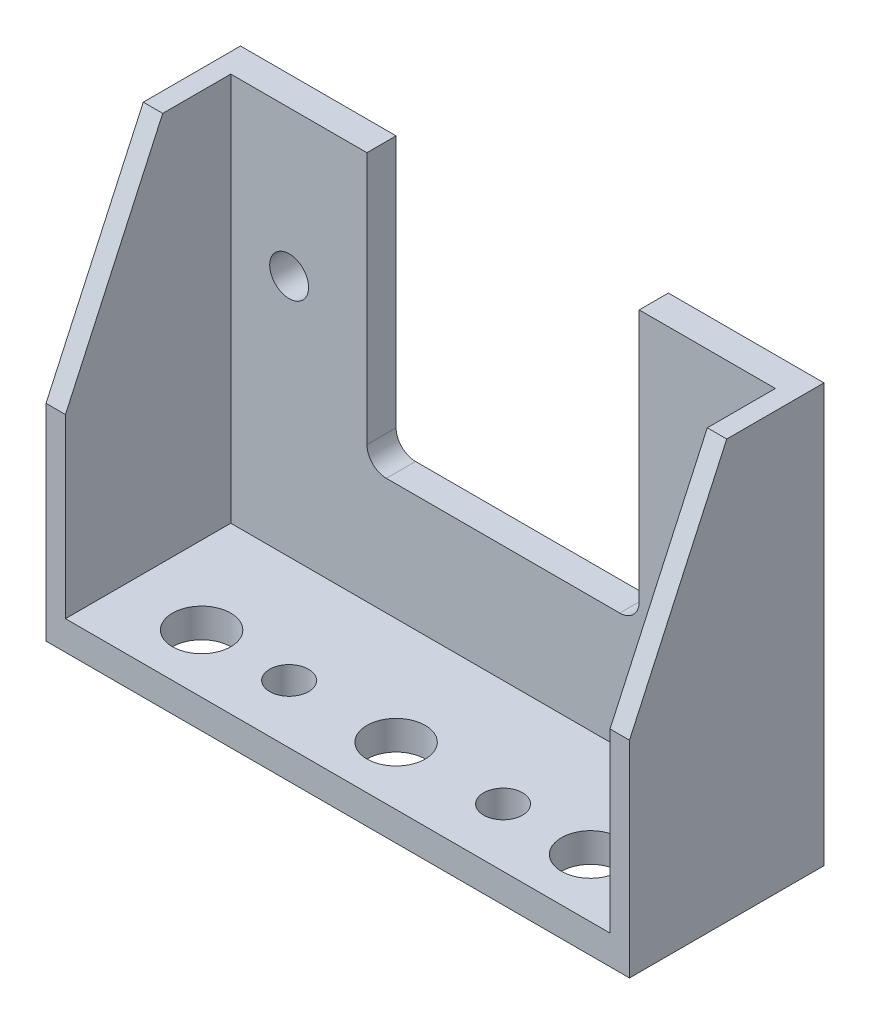
ISO-10303-21;
HEADER;
FILE_DESCRIPTION(('STEP AP214'),'2;1');
FILE_NAME('part.step','',(''),(''),'','','');
FILE_SCHEMA(('AUTOMOTIVE_DESIGN { 1 0 10303 214 1 1 1 1 }'));
ENDSEC;
DATA;
#1=APPLICATION_CONTEXT('core data for automotive mechanical design processes');
#2=APPLICATION_PROTOCOL_DEFINITION('international standard','automotive_design',2000,#1);
#3=PRODUCT_CONTEXT('',#1,'mechanical');
#4=PRODUCT('Part','Part','',(#3));
#5=PRODUCT_RELATED_PRODUCT_CATEGORY('part','',(#4));
#6=PRODUCT_DEFINITION_FORMATION('','',#4);
#7=PRODUCT_DEFINITION_CONTEXT('part definition',#1,'design');
#8=PRODUCT_DEFINITION('design','',#6,#7);
#9=PRODUCT_DEFINITION_SHAPE('','',#8);
#10=(LENGTH_UNIT() NAMED_UNIT(*) SI_UNIT(.MILLI.,.METRE.));
#11=(NAMED_UNIT(*) PLANE_ANGLE_UNIT() SI_UNIT($,.RADIAN.));
#12=(NAMED_UNIT(*) SI_UNIT($,.STERADIAN.) SOLID_ANGLE_UNIT());
#13=UNCERTAINTY_MEASURE_WITH_UNIT(LENGTH_MEASURE(1.E-05),#10,'distance_accuracy_value','');
#14=(GEOMETRIC_REPRESENTATION_CONTEXT(3) GLOBAL_UNCERTAINTY_ASSIGNED_CONTEXT((#13)) GLOBAL_UNIT_ASSIGNED_CONTEXT((#10,
#11,#12)) REPRESENTATION_CONTEXT('',''));
#15=CARTESIAN_POINT('',(0.,0.,0.));
#16=DIRECTION('',(0.,0.,1.));
#17=DIRECTION('',(1.,0.,0.));
#18=AXIS2_PLACEMENT_3D('',#15,#16,#17);
#19=CARTESIAN_POINT('',(0.,0.75,0.));
#20=DIRECTION('',(0.,1.,0.));
#21=DIRECTION('',(0.,0.,1.));
#22=AXIS2_PLACEMENT_3D('',#19,#20,#21);
#23=PLANE('',#22);
#24=CARTESIAN_POINT('',(-10.,0.75,2.));
#25=DIRECTION('',(0.,1.,0.));
#26=DIRECTION('',(0.,0.,1.));
#27=AXIS2_PLACEMENT_3D('',#24,#25,#26);
#28=CIRCLE('',#27,1.5);
#29=CARTESIAN_POINT('',(-10.,0.75,3.5));
#30=VERTEX_POINT('',#29);
#31=EDGE_CURVE('E299',#30,#30,#28,.T.);
#32=ORIENTED_EDGE('',*,*,#31,.F.);
#33=EDGE_LOOP('',(#32));
#34=FACE_BOUND('',#33,.T.);
#35=CARTESIAN_POINT('',(5.5,0.75,2.));
#36=DIRECTION('',(0.,1.,0.));
#37=DIRECTION('',(0.,0.,-1.));
#38=AXIS2_PLACEMENT_3D('',#35,#36,#37);
#39=CIRCLE('',#38,1.);
#40=CARTESIAN_POINT('',(5.5,0.75,0.999999999999999));
#41=VERTEX_POINT('',#40);
#42=EDGE_CURVE('E304',#41,#41,#39,.T.);
#43=ORIENTED_EDGE('',*,*,#42,.F.);
#44=EDGE_LOOP('',(#43));
#45=FACE_BOUND('',#44,.T.);
#46=CARTESIAN_POINT('',(-5.5,0.75,2.));
#47=DIRECTION('',(0.,1.,0.));
#48=DIRECTION('',(0.,0.,1.));
#49=AXIS2_PLACEMENT_3D('',#46,#47,#48);
#50=CIRCLE('',#49,1.);
#51=CARTESIAN_POINT('',(-5.5,0.75,3.));
#52=VERTEX_POINT('',#51);
#53=EDGE_CURVE('E319',#52,#52,#50,.T.);
#54=ORIENTED_EDGE('',*,*,#53,.F.);
#55=EDGE_LOOP('',(#54));
#56=FACE_BOUND('',#55,.T.);
#57=CARTESIAN_POINT('',(10.,0.75,2.));
#58=DIRECTION('',(0.,1.,0.));
#59=DIRECTION('',(0.,0.,-1.));
#60=AXIS2_PLACEMENT_3D('',#57,#58,#59);
#61=CIRCLE('',#60,1.5);
#62=CARTESIAN_POINT('',(10.,0.75,0.499999999999999));
#63=VERTEX_POINT('',#62);
#64=EDGE_CURVE('E303',#63,#63,#61,.T.);
#65=ORIENTED_EDGE('',*,*,#64,.F.);
#66=EDGE_LOOP('',(#65));
#67=FACE_BOUND('',#66,.T.);
#68=CARTESIAN_POINT('',(0.,0.75,2.));
#69=DIRECTION('',(0.,1.,0.));
#70=DIRECTION('',(0.,0.,1.));
#71=AXIS2_PLACEMENT_3D('',#68,#69,#70);
#72=CIRCLE('',#71,1.5);
#73=CARTESIAN_POINT('',(0.,0.75,3.5));
#74=VERTEX_POINT('',#73);
#75=EDGE_CURVE('E326',#74,#74,#72,.T.);
#76=ORIENTED_EDGE('',*,*,#75,.F.);
#77=EDGE_LOOP('',(#76));
#78=FACE_BOUND('',#77,.T.);
#79=DIRECTION('',(-1.,0.,0.));
#80=VECTOR('',#79,1.);
#81=CARTESIAN_POINT('',(0.,0.75,-3.5));
#82=LINE('',#81,#80);
#83=CARTESIAN_POINT('',(14.,0.75,-3.5));
#84=VERTEX_POINT('',#83);
#85=CARTESIAN_POINT('',(-14.,0.75,-3.5));
#86=VERTEX_POINT('',#85);
#87=EDGE_CURVE('E261',#84,#86,#82,.T.);
#88=ORIENTED_EDGE('',*,*,#87,.T.);
#89=DIRECTION('',(0.,0.,1.));
#90=VECTOR('',#89,1.);
#91=CARTESIAN_POINT('',(-14.,0.75,0.));
#92=LINE('',#91,#90);
#93=CARTESIAN_POINT('',(-14.,0.75,5.));
#94=VERTEX_POINT('',#93);
#95=EDGE_CURVE('E66',#86,#94,#92,.T.);
#96=ORIENTED_EDGE('',*,*,#95,.T.);
#97=DIRECTION('',(1.,0.,0.));
#98=VECTOR('',#97,1.);
#99=CARTESIAN_POINT('',(-15.,0.75,5.));
#100=LINE('',#99,#98);
#101=CARTESIAN_POINT('',(14.,0.75,5.));
#102=VERTEX_POINT('',#101);
#103=EDGE_CURVE('E334',#94,#102,#100,.T.);
#104=ORIENTED_EDGE('',*,*,#103,.T.);
#105=DIRECTION('',(0.,0.,1.));
#106=VECTOR('',#105,1.);
#107=CARTESIAN_POINT('',(14.,0.75,0.));
#108=LINE('',#107,#106);
#109=EDGE_CURVE('E220',#84,#102,#108,.T.);
#110=ORIENTED_EDGE('',*,*,#109,.F.);
#111=EDGE_LOOP('',(#88,#96,#104,#110));
#112=FACE_BOUND('',#111,.T.);
#113=ADVANCED_FACE('F43',(#34,#45,#56,#67,#78,#112),#23,.T.);
#114=CARTESIAN_POINT('',(0.,0.,-3.5));
#115=DIRECTION('',(0.,0.,1.));
#116=DIRECTION('',(1.,0.,0.));
#117=AXIS2_PLACEMENT_3D('',#114,#115,#116);
#118=PLANE('',#117);
#119=CARTESIAN_POINT('',(-11.,13.25,-3.5));
#120=DIRECTION('',(0.,0.,1.));
#121=DIRECTION('',(1.,0.,0.));
#122=AXIS2_PLACEMENT_3D('',#119,#120,#121);
#123=CIRCLE('',#122,1.);
#124=CARTESIAN_POINT('',(-10.,13.25,-3.5));
#125=VERTEX_POINT('',#124);
#126=EDGE_CURVE('E238',#125,#125,#123,.T.);
#127=ORIENTED_EDGE('',*,*,#126,.F.);
#128=EDGE_LOOP('',(#127));
#129=FACE_BOUND('',#128,.T.);
#130=CARTESIAN_POINT('',(11.,13.25,-3.5));
#131=DIRECTION('',(0.,0.,1.));
#132=DIRECTION('',(1.,0.,0.));
#133=AXIS2_PLACEMENT_3D('',#130,#131,#132);
#134=CIRCLE('',#133,1.);
#135=CARTESIAN_POINT('',(12.,13.25,-3.5));
#136=VERTEX_POINT('',#135);
#137=EDGE_CURVE('E233',#136,#136,#134,.T.);
#138=ORIENTED_EDGE('',*,*,#137,.F.);
#139=EDGE_LOOP('',(#138));
#140=FACE_BOUND('',#139,.T.);
#141=DIRECTION('',(-1.,0.,0.));
#142=VECTOR('',#141,1.);
#143=CARTESIAN_POINT('',(0.,20.75,-3.5));
#144=LINE('',#143,#142);
#145=CARTESIAN_POINT('',(-7.,20.75,-3.5));
#146=VERTEX_POINT('',#145);
#147=CARTESIAN_POINT('',(-14.,20.75,-3.5));
#148=VERTEX_POINT('',#147);
#149=EDGE_CURVE('E249',#146,#148,#144,.T.);
#150=ORIENTED_EDGE('',*,*,#149,.T.);
#151=DIRECTION('',(0.,-1.,0.));
#152=VECTOR('',#151,1.);
#153=CARTESIAN_POINT('',(-14.,0.,-3.5));
#154=LINE('',#153,#152);
#155=EDGE_CURVE('E59',#148,#86,#154,.T.);
#156=ORIENTED_EDGE('',*,*,#155,.T.);
#157=ORIENTED_EDGE('',*,*,#87,.F.);
#158=DIRECTION('',(0.,-1.,0.));
#159=VECTOR('',#158,1.);
#160=CARTESIAN_POINT('',(14.,0.,-3.5));
#161=LINE('',#160,#159);
#162=CARTESIAN_POINT('',(14.,20.75,-3.5));
#163=VERTEX_POINT('',#162);
#164=EDGE_CURVE('E209',#163,#84,#161,.T.);
#165=ORIENTED_EDGE('',*,*,#164,.F.);
#166=CARTESIAN_POINT('',(7.,20.75,-3.5));
#167=VERTEX_POINT('',#166);
#168=EDGE_CURVE('E244',#163,#167,#144,.T.);
#169=ORIENTED_EDGE('',*,*,#168,.T.);
#170=DIRECTION('',(0.,-1.,0.));
#171=VECTOR('',#170,1.);
#172=CARTESIAN_POINT('',(7.,0.,-3.5));
#173=LINE('',#172,#171);
#174=CARTESIAN_POINT('',(7.,7.75,-3.5));
#175=VERTEX_POINT('',#174);
#176=EDGE_CURVE('E247',#167,#175,#173,.T.);
#177=ORIENTED_EDGE('',*,*,#176,.T.);
#178=CARTESIAN_POINT('',(6.,7.75,-3.5));
#179=DIRECTION('',(0.,0.,1.));
#180=DIRECTION('',(1.,0.,0.));
#181=AXIS2_PLACEMENT_3D('',#178,#179,#180);
#182=CIRCLE('',#181,1.);
#183=CARTESIAN_POINT('',(6.,6.75,-3.5));
#184=VERTEX_POINT('',#183);
#185=EDGE_CURVE('E380',#175,#184,#182,.F.);
#186=ORIENTED_EDGE('',*,*,#185,.T.);
#187=DIRECTION('',(1.,0.,0.));
#188=VECTOR('',#187,1.);
#189=CARTESIAN_POINT('',(0.,6.75,-3.5));
#190=LINE('',#189,#188);
#191=CARTESIAN_POINT('',(-6.,6.75,-3.5));
#192=VERTEX_POINT('',#191);
#193=EDGE_CURVE('E253',#192,#184,#190,.T.);
#194=ORIENTED_EDGE('',*,*,#193,.F.);
#195=CARTESIAN_POINT('',(-6.,7.75,-3.5));
#196=DIRECTION('',(0.,0.,1.));
#197=DIRECTION('',(1.,0.,0.));
#198=AXIS2_PLACEMENT_3D('',#195,#196,#197);
#199=CIRCLE('',#198,1.);
#200=CARTESIAN_POINT('',(-7.,7.75,-3.5));
#201=VERTEX_POINT('',#200);
#202=EDGE_CURVE('E11',#192,#201,#199,.F.);
#203=ORIENTED_EDGE('',*,*,#202,.T.);
#204=DIRECTION('',(0.,-1.,0.));
#205=VECTOR('',#204,1.);
#206=CARTESIAN_POINT('',(-6.99999999999999,0.,-3.5));
#207=LINE('',#206,#205);
#208=EDGE_CURVE('E257',#146,#201,#207,.T.);
#209=ORIENTED_EDGE('',*,*,#208,.F.);
#210=EDGE_LOOP('',(#150,#156,#157,#165,#169,#177,#186,#194,#203,#209));
#211=FACE_BOUND('',#210,.T.);
#212=ADVANCED_FACE('F397',(#129,#140,#211),#118,.T.);
#213=CARTESIAN_POINT('',(0.,-0.75,0.));
#214=DIRECTION('',(0.,1.,0.));
#215=DIRECTION('',(0.,0.,1.));
#216=AXIS2_PLACEMENT_3D('',#213,#214,#215);
#217=PLANE('',#216);
#218=CARTESIAN_POINT('',(-10.,-0.75,2.));
#219=DIRECTION('',(0.,1.,0.));
#220=DIRECTION('',(0.,0.,1.));
#221=AXIS2_PLACEMENT_3D('',#218,#219,#220);
#222=CIRCLE('',#221,1.5);
#223=CARTESIAN_POINT('',(-10.,-0.75,3.5));
#224=VERTEX_POINT('',#223);
#225=EDGE_CURVE('E294',#224,#224,#222,.T.);
#226=ORIENTED_EDGE('',*,*,#225,.T.);
#227=EDGE_LOOP('',(#226));
#228=FACE_BOUND('',#227,.T.);
#229=CARTESIAN_POINT('',(5.5,-0.75,2.));
#230=DIRECTION('',(0.,1.,0.));
#231=DIRECTION('',(0.,0.,-1.));
#232=AXIS2_PLACEMENT_3D('',#229,#230,#231);
#233=CIRCLE('',#232,1.);
#234=CARTESIAN_POINT('',(5.5,-0.75,0.999999999999999));
#235=VERTEX_POINT('',#234);
#236=EDGE_CURVE('E293',#235,#235,#233,.T.);
#237=ORIENTED_EDGE('',*,*,#236,.T.);
#238=EDGE_LOOP('',(#237));
#239=FACE_BOUND('',#238,.T.);
#240=CARTESIAN_POINT('',(-5.5,-0.75,2.));
#241=DIRECTION('',(0.,1.,0.));
#242=DIRECTION('',(0.,0.,1.));
#243=AXIS2_PLACEMENT_3D('',#240,#241,#242);
#244=CIRCLE('',#243,1.);
#245=CARTESIAN_POINT('',(-5.5,-0.75,3.));
#246=VERTEX_POINT('',#245);
#247=EDGE_CURVE('E308',#246,#246,#244,.T.);
#248=ORIENTED_EDGE('',*,*,#247,.T.);
#249=EDGE_LOOP('',(#248));
#250=FACE_BOUND('',#249,.T.);
#251=CARTESIAN_POINT('',(10.,-0.75,2.));
#252=DIRECTION('',(0.,1.,0.));
#253=DIRECTION('',(0.,0.,-1.));
#254=AXIS2_PLACEMENT_3D('',#251,#252,#253);
#255=CIRCLE('',#254,1.5);
#256=CARTESIAN_POINT('',(10.,-0.75,0.499999999999999));
#257=VERTEX_POINT('',#256);
#258=EDGE_CURVE('E315',#257,#257,#255,.T.);
#259=ORIENTED_EDGE('',*,*,#258,.T.);
#260=EDGE_LOOP('',(#259));
#261=FACE_BOUND('',#260,.T.);
#262=DIRECTION('',(0.,0.,-1.));
#263=VECTOR('',#262,1.);
#264=CARTESIAN_POINT('',(15.,-0.75,-5.));
#265=LINE('',#264,#263);
#266=CARTESIAN_POINT('',(15.,-0.75,5.));
#267=VERTEX_POINT('',#266);
#268=CARTESIAN_POINT('',(15.,-0.75,-5.));
#269=VERTEX_POINT('',#268);
#270=EDGE_CURVE('E330',#267,#269,#265,.T.);
#271=ORIENTED_EDGE('',*,*,#270,.F.);
#272=DIRECTION('',(1.,0.,0.));
#273=VECTOR('',#272,1.);
#274=CARTESIAN_POINT('',(-15.,-0.75,5.));
#275=LINE('',#274,#273);
#276=CARTESIAN_POINT('',(-15.,-0.75,5.));
#277=VERTEX_POINT('',#276);
#278=EDGE_CURVE('E337',#277,#267,#275,.T.);
#279=ORIENTED_EDGE('',*,*,#278,.F.);
#280=DIRECTION('',(0.,0.,1.));
#281=VECTOR('',#280,1.);
#282=CARTESIAN_POINT('',(-15.,-0.75,-5.));
#283=LINE('',#282,#281);
#284=CARTESIAN_POINT('',(-15.,-0.75,-5.));
#285=VERTEX_POINT('',#284);
#286=EDGE_CURVE('E165',#285,#277,#283,.T.);
#287=ORIENTED_EDGE('',*,*,#286,.F.);
#288=DIRECTION('',(-1.,0.,0.));
#289=VECTOR('',#288,1.);
#290=CARTESIAN_POINT('',(-15.,-0.75,-5.));
#291=LINE('',#290,#289);
#292=EDGE_CURVE('E341',#269,#285,#291,.T.);
#293=ORIENTED_EDGE('',*,*,#292,.F.);
#294=EDGE_LOOP('',(#271,#279,#287,#293));
#295=FACE_BOUND('',#294,.T.);
#296=CARTESIAN_POINT('',(0.,-0.75,2.));
#297=DIRECTION('',(0.,1.,0.));
#298=DIRECTION('',(0.,0.,1.));
#299=AXIS2_PLACEMENT_3D('',#296,#297,#298);
#300=CIRCLE('',#299,1.5);
#301=CARTESIAN_POINT('',(0.,-0.75,3.5));
#302=VERTEX_POINT('',#301);
#303=EDGE_CURVE('E298',#302,#302,#300,.T.);
#304=ORIENTED_EDGE('',*,*,#303,.T.);
#305=EDGE_LOOP('',(#304));
#306=FACE_BOUND('',#305,.T.);
#307=ADVANCED_FACE('F409',(#228,#239,#250,#261,#295,#306),#217,.F.);
#308=CARTESIAN_POINT('',(15.,0.75,-5.));
#309=DIRECTION('',(-1.,0.,0.));
#310=DIRECTION('',(0.,0.,1.));
#311=AXIS2_PLACEMENT_3D('',#308,#309,#310);
#312=PLANE('',#311);
#313=ORIENTED_EDGE('',*,*,#270,.T.);
#314=DIRECTION('',(0.,-1.,0.));
#315=VECTOR('',#314,1.);
#316=CARTESIAN_POINT('',(15.,0.75,-5.));
#317=LINE('',#316,#315);
#318=CARTESIAN_POINT('',(15.,20.75,-5.));
#319=VERTEX_POINT('',#318);
#320=EDGE_CURVE('E353',#319,#269,#317,.T.);
#321=ORIENTED_EDGE('',*,*,#320,.F.);
#322=DIRECTION('',(0.,0.,-1.));
#323=VECTOR('',#322,1.);
#324=CARTESIAN_POINT('',(15.,20.75,-3.5));
#325=LINE('',#324,#323);
#326=CARTESIAN_POINT('',(15.,20.75,0.));
#327=VERTEX_POINT('',#326);
#328=EDGE_CURVE('E264',#327,#319,#325,.T.);
#329=ORIENTED_EDGE('',*,*,#328,.F.);
#330=DIRECTION('',(0.,-0.909077237208885,0.416627623650497));
#331=VECTOR('',#330,1.);
#332=CARTESIAN_POINT('',(15.,3.60175546836469,7.85899379785176));
#333=LINE('',#332,#331);
#334=CARTESIAN_POINT('',(15.,9.84005085592335,5.));
#335=VERTEX_POINT('',#334);
#336=EDGE_CURVE('E204',#327,#335,#333,.T.);
#337=ORIENTED_EDGE('',*,*,#336,.T.);
#338=DIRECTION('',(0.,-1.,0.));
#339=VECTOR('',#338,1.);
#340=CARTESIAN_POINT('',(15.,0.75,5.));
#341=LINE('',#340,#339);
#342=EDGE_CURVE('E170',#335,#267,#341,.T.);
#343=ORIENTED_EDGE('',*,*,#342,.T.);
#344=EDGE_LOOP('',(#313,#321,#329,#337,#343));
#345=FACE_BOUND('',#344,.T.);
#346=ADVANCED_FACE('F412',(#345),#312,.F.);
#347=CARTESIAN_POINT('',(-15.,0.75,-5.));
#348=DIRECTION('',(0.,0.,1.));
#349=DIRECTION('',(1.,0.,0.));
#350=AXIS2_PLACEMENT_3D('',#347,#348,#349);
#351=PLANE('',#350);
#352=CARTESIAN_POINT('',(-11.,13.25,-5.));
#353=DIRECTION('',(0.,0.,1.));
#354=DIRECTION('',(1.,0.,0.));
#355=AXIS2_PLACEMENT_3D('',#352,#353,#354);
#356=CIRCLE('',#355,1.);
#357=CARTESIAN_POINT('',(-10.,13.25,-5.));
#358=VERTEX_POINT('',#357);
#359=EDGE_CURVE('E239',#358,#358,#356,.T.);
#360=ORIENTED_EDGE('',*,*,#359,.T.);
#361=EDGE_LOOP('',(#360));
#362=FACE_BOUND('',#361,.T.);
#363=CARTESIAN_POINT('',(11.,13.25,-5.));
#364=DIRECTION('',(0.,0.,1.));
#365=DIRECTION('',(1.,0.,0.));
#366=AXIS2_PLACEMENT_3D('',#363,#364,#365);
#367=CIRCLE('',#366,1.);
#368=CARTESIAN_POINT('',(12.,13.25,-5.));
#369=VERTEX_POINT('',#368);
#370=EDGE_CURVE('E234',#369,#369,#367,.T.);
#371=ORIENTED_EDGE('',*,*,#370,.T.);
#372=EDGE_LOOP('',(#371));
#373=FACE_BOUND('',#372,.T.);
#374=ORIENTED_EDGE('',*,*,#292,.T.);
#375=DIRECTION('',(0.,-1.,0.));
#376=VECTOR('',#375,1.);
#377=CARTESIAN_POINT('',(-15.,0.75,-5.));
#378=LINE('',#377,#376);
#379=CARTESIAN_POINT('',(-15.,20.75,-5.));
#380=VERTEX_POINT('',#379);
#381=EDGE_CURVE('E169',#380,#285,#378,.T.);
#382=ORIENTED_EDGE('',*,*,#381,.F.);
#383=DIRECTION('',(-1.,0.,0.));
#384=VECTOR('',#383,1.);
#385=CARTESIAN_POINT('',(0.,20.75,-5.));
#386=LINE('',#385,#384);
#387=CARTESIAN_POINT('',(-7.,20.75,-5.));
#388=VERTEX_POINT('',#387);
#389=EDGE_CURVE('E248',#388,#380,#386,.T.);
#390=ORIENTED_EDGE('',*,*,#389,.F.);
#391=DIRECTION('',(0.,-1.,0.));
#392=VECTOR('',#391,1.);
#393=CARTESIAN_POINT('',(-6.99999999999999,0.,-5.));
#394=LINE('',#393,#392);
#395=CARTESIAN_POINT('',(-7.,7.75,-5.));
#396=VERTEX_POINT('',#395);
#397=EDGE_CURVE('E276',#388,#396,#394,.T.);
#398=ORIENTED_EDGE('',*,*,#397,.T.);
#399=CARTESIAN_POINT('',(-6.,7.75,-5.));
#400=DIRECTION('',(0.,0.,1.));
#401=DIRECTION('',(1.,0.,0.));
#402=AXIS2_PLACEMENT_3D('',#399,#400,#401);
#403=CIRCLE('',#402,1.);
#404=CARTESIAN_POINT('',(-6.,6.75,-5.));
#405=VERTEX_POINT('',#404);
#406=EDGE_CURVE('E52',#396,#405,#403,.T.);
#407=ORIENTED_EDGE('',*,*,#406,.T.);
#408=DIRECTION('',(1.,0.,0.));
#409=VECTOR('',#408,1.);
#410=CARTESIAN_POINT('',(0.,6.75,-5.));
#411=LINE('',#410,#409);
#412=CARTESIAN_POINT('',(6.,6.75,-5.));
#413=VERTEX_POINT('',#412);
#414=EDGE_CURVE('E272',#405,#413,#411,.T.);
#415=ORIENTED_EDGE('',*,*,#414,.T.);
#416=CARTESIAN_POINT('',(6.,7.75,-5.));
#417=DIRECTION('',(0.,0.,1.));
#418=DIRECTION('',(1.,0.,0.));
#419=AXIS2_PLACEMENT_3D('',#416,#417,#418);
#420=CIRCLE('',#419,1.);
#421=CARTESIAN_POINT('',(7.,7.75,-5.));
#422=VERTEX_POINT('',#421);
#423=EDGE_CURVE('E377',#413,#422,#420,.T.);
#424=ORIENTED_EDGE('',*,*,#423,.T.);
#425=DIRECTION('',(0.,-1.,0.));
#426=VECTOR('',#425,1.);
#427=CARTESIAN_POINT('',(7.,0.,-5.));
#428=LINE('',#427,#426);
#429=CARTESIAN_POINT('',(7.,20.75,-5.));
#430=VERTEX_POINT('',#429);
#431=EDGE_CURVE('E268',#430,#422,#428,.T.);
#432=ORIENTED_EDGE('',*,*,#431,.F.);
#433=EDGE_CURVE('E243',#319,#430,#386,.T.);
#434=ORIENTED_EDGE('',*,*,#433,.F.);
#435=ORIENTED_EDGE('',*,*,#320,.T.);
#436=EDGE_LOOP('',(#374,#382,#390,#398,#407,#415,#424,#432,#434,#435));
#437=FACE_BOUND('',#436,.T.);
#438=ADVANCED_FACE('F385',(#362,#373,#437),#351,.F.);
#439=CARTESIAN_POINT('',(-15.,0.75,-5.));
#440=DIRECTION('',(1.,0.,0.));
#441=DIRECTION('',(0.,0.,-1.));
#442=AXIS2_PLACEMENT_3D('',#439,#440,#441);
#443=PLANE('',#442);
#444=ORIENTED_EDGE('',*,*,#286,.T.);
#445=DIRECTION('',(0.,-1.,0.));
#446=VECTOR('',#445,1.);
#447=CARTESIAN_POINT('',(-15.,0.75,5.));
#448=LINE('',#447,#446);
#449=CARTESIAN_POINT('',(-15.,9.84005085592335,5.));
#450=VERTEX_POINT('',#449);
#451=EDGE_CURVE('E157',#450,#277,#448,.T.);
#452=ORIENTED_EDGE('',*,*,#451,.F.);
#453=DIRECTION('',(0.,-0.909077237208885,0.416627623650497));
#454=VECTOR('',#453,1.);
#455=CARTESIAN_POINT('',(-15.,3.60175546836469,7.85899379785176));
#456=LINE('',#455,#454);
#457=CARTESIAN_POINT('',(-15.,20.75,0.));
#458=VERTEX_POINT('',#457);
#459=EDGE_CURVE('E162',#458,#450,#456,.T.);
#460=ORIENTED_EDGE('',*,*,#459,.F.);
#461=DIRECTION('',(0.,0.,-1.));
#462=VECTOR('',#461,1.);
#463=CARTESIAN_POINT('',(-15.,20.75,-3.5));
#464=LINE('',#463,#462);
#465=EDGE_CURVE('E283',#458,#380,#464,.T.);
#466=ORIENTED_EDGE('',*,*,#465,.T.);
#467=ORIENTED_EDGE('',*,*,#381,.T.);
#468=EDGE_LOOP('',(#444,#452,#460,#466,#467));
#469=FACE_BOUND('',#468,.T.);
#470=ADVANCED_FACE('F159',(#469),#443,.F.);
#471=CARTESIAN_POINT('',(-15.,0.75,5.));
#472=DIRECTION('',(0.,0.,-1.));
#473=DIRECTION('',(-1.,0.,0.));
#474=AXIS2_PLACEMENT_3D('',#471,#472,#473);
#475=PLANE('',#474);
#476=ORIENTED_EDGE('',*,*,#278,.T.);
#477=ORIENTED_EDGE('',*,*,#342,.F.);
#478=DIRECTION('',(-1.,0.,0.));
#479=VECTOR('',#478,1.);
#480=CARTESIAN_POINT('',(15.,9.84005085592335,5.));
#481=LINE('',#480,#479);
#482=CARTESIAN_POINT('',(14.,9.84005085592335,5.));
#483=VERTEX_POINT('',#482);
#484=EDGE_CURVE('E208',#335,#483,#481,.T.);
#485=ORIENTED_EDGE('',*,*,#484,.T.);
#486=DIRECTION('',(0.,-1.,0.));
#487=VECTOR('',#486,1.);
#488=CARTESIAN_POINT('',(14.,0.,5.));
#489=LINE('',#488,#487);
#490=EDGE_CURVE('E216',#483,#102,#489,.T.);
#491=ORIENTED_EDGE('',*,*,#490,.T.);
#492=ORIENTED_EDGE('',*,*,#103,.F.);
#493=DIRECTION('',(0.,-1.,0.));
#494=VECTOR('',#493,1.);
#495=CARTESIAN_POINT('',(-14.,0.,5.));
#496=LINE('',#495,#494);
#497=CARTESIAN_POINT('',(-14.,9.84005085592335,5.));
#498=VERTEX_POINT('',#497);
#499=EDGE_CURVE('E176',#498,#94,#496,.T.);
#500=ORIENTED_EDGE('',*,*,#499,.F.);
#501=DIRECTION('',(1.,0.,0.));
#502=VECTOR('',#501,1.);
#503=CARTESIAN_POINT('',(-15.,9.84005085592335,5.));
#504=LINE('',#503,#502);
#505=EDGE_CURVE('E173',#450,#498,#504,.T.);
#506=ORIENTED_EDGE('',*,*,#505,.F.);
#507=ORIENTED_EDGE('',*,*,#451,.T.);
#508=EDGE_LOOP('',(#476,#477,#485,#491,#492,#500,#506,#507));
#509=FACE_BOUND('',#508,.T.);
#510=ADVANCED_FACE('F174',(#509),#475,.F.);
#511=CARTESIAN_POINT('',(0.,0.75,2.));
#512=DIRECTION('',(0.,-1.,0.));
#513=DIRECTION('',(0.,0.,-1.));
#514=AXIS2_PLACEMENT_3D('',#511,#512,#513);
#515=CYLINDRICAL_SURFACE('',#514,1.5);
#516=ORIENTED_EDGE('',*,*,#75,.T.);
#517=EDGE_LOOP('',(#516));
#518=FACE_BOUND('',#517,.T.);
#519=ORIENTED_EDGE('',*,*,#303,.F.);
#520=EDGE_LOOP('',(#519));
#521=FACE_BOUND('',#520,.T.);
#522=ADVANCED_FACE('F457',(#518,#521),#515,.F.);
#523=CARTESIAN_POINT('',(10.,-0.75,2.));
#524=DIRECTION('',(0.,1.,0.));
#525=DIRECTION('',(0.,0.,1.));
#526=AXIS2_PLACEMENT_3D('',#523,#524,#525);
#527=CYLINDRICAL_SURFACE('',#526,1.5);
#528=ORIENTED_EDGE('',*,*,#258,.F.);
#529=EDGE_LOOP('',(#528));
#530=FACE_BOUND('',#529,.T.);
#531=ORIENTED_EDGE('',*,*,#64,.T.);
#532=EDGE_LOOP('',(#531));
#533=FACE_BOUND('',#532,.T.);
#534=ADVANCED_FACE('F497',(#530,#533),#527,.F.);
#535=CARTESIAN_POINT('',(-5.5,-0.75,2.));
#536=DIRECTION('',(0.,1.,0.));
#537=DIRECTION('',(0.,0.,1.));
#538=AXIS2_PLACEMENT_3D('',#535,#536,#537);
#539=CYLINDRICAL_SURFACE('',#538,1.);
#540=ORIENTED_EDGE('',*,*,#247,.F.);
#541=EDGE_LOOP('',(#540));
#542=FACE_BOUND('',#541,.T.);
#543=ORIENTED_EDGE('',*,*,#53,.T.);
#544=EDGE_LOOP('',(#543));
#545=FACE_BOUND('',#544,.T.);
#546=ADVANCED_FACE('F504',(#542,#545),#539,.F.);
#547=CARTESIAN_POINT('',(5.5,-0.75,2.));
#548=DIRECTION('',(0.,1.,0.));
#549=DIRECTION('',(0.,0.,1.));
#550=AXIS2_PLACEMENT_3D('',#547,#548,#549);
#551=CYLINDRICAL_SURFACE('',#550,1.);
#552=ORIENTED_EDGE('',*,*,#236,.F.);
#553=EDGE_LOOP('',(#552));
#554=FACE_BOUND('',#553,.T.);
#555=ORIENTED_EDGE('',*,*,#42,.T.);
#556=EDGE_LOOP('',(#555));
#557=FACE_BOUND('',#556,.T.);
#558=ADVANCED_FACE('F512',(#554,#557),#551,.F.);
#559=CARTESIAN_POINT('',(-10.,-0.75,2.));
#560=DIRECTION('',(0.,1.,0.));
#561=DIRECTION('',(0.,0.,1.));
#562=AXIS2_PLACEMENT_3D('',#559,#560,#561);
#563=CYLINDRICAL_SURFACE('',#562,1.5);
#564=ORIENTED_EDGE('',*,*,#225,.F.);
#565=EDGE_LOOP('',(#564));
#566=FACE_BOUND('',#565,.T.);
#567=ORIENTED_EDGE('',*,*,#31,.T.);
#568=EDGE_LOOP('',(#567));
#569=FACE_BOUND('',#568,.T.);
#570=ADVANCED_FACE('F519',(#566,#569),#563,.F.);
#571=CARTESIAN_POINT('',(0.,20.75,-3.5));
#572=DIRECTION('',(0.,-1.,0.));
#573=DIRECTION('',(1.,0.,0.));
#574=AXIS2_PLACEMENT_3D('',#571,#572,#573);
#575=PLANE('',#574);
#576=ORIENTED_EDGE('',*,*,#433,.T.);
#577=DIRECTION('',(0.,0.,-1.));
#578=VECTOR('',#577,1.);
#579=CARTESIAN_POINT('',(7.,20.75,-3.5));
#580=LINE('',#579,#578);
#581=EDGE_CURVE('E289',#167,#430,#580,.T.);
#582=ORIENTED_EDGE('',*,*,#581,.F.);
#583=ORIENTED_EDGE('',*,*,#168,.F.);
#584=DIRECTION('',(0.,0.,1.));
#585=VECTOR('',#584,1.);
#586=CARTESIAN_POINT('',(14.,20.75,0.));
#587=LINE('',#586,#585);
#588=CARTESIAN_POINT('',(14.,20.75,0.));
#589=VERTEX_POINT('',#588);
#590=EDGE_CURVE('E181',#163,#589,#587,.T.);
#591=ORIENTED_EDGE('',*,*,#590,.T.);
#592=DIRECTION('',(-1.,0.,0.));
#593=VECTOR('',#592,1.);
#594=CARTESIAN_POINT('',(15.,20.75,0.));
#595=LINE('',#594,#593);
#596=EDGE_CURVE('E229',#327,#589,#595,.T.);
#597=ORIENTED_EDGE('',*,*,#596,.F.);
#598=ORIENTED_EDGE('',*,*,#328,.T.);
#599=EDGE_LOOP('',(#576,#582,#583,#591,#597,#598));
#600=FACE_BOUND('',#599,.T.);
#601=ADVANCED_FACE('F427',(#600),#575,.F.);
#602=CARTESIAN_POINT('',(7.,0.,-3.5));
#603=DIRECTION('',(1.,0.,0.));
#604=DIRECTION('',(0.,1.,0.));
#605=AXIS2_PLACEMENT_3D('',#602,#603,#604);
#606=PLANE('',#605);
#607=ORIENTED_EDGE('',*,*,#431,.T.);
#608=DIRECTION('',(0.,0.,-1.));
#609=VECTOR('',#608,1.);
#610=CARTESIAN_POINT('',(7.,7.75,-3.5));
#611=LINE('',#610,#609);
#612=EDGE_CURVE('E370',#422,#175,#611,.F.);
#613=ORIENTED_EDGE('',*,*,#612,.T.);
#614=ORIENTED_EDGE('',*,*,#176,.F.);
#615=ORIENTED_EDGE('',*,*,#581,.T.);
#616=EDGE_LOOP('',(#607,#613,#614,#615));
#617=FACE_BOUND('',#616,.T.);
#618=ADVANCED_FACE('F430',(#617),#606,.F.);
#619=CARTESIAN_POINT('',(0.,6.75,-3.5));
#620=DIRECTION('',(0.,1.,0.));
#621=DIRECTION('',(0.,0.,1.));
#622=AXIS2_PLACEMENT_3D('',#619,#620,#621);
#623=PLANE('',#622);
#624=ORIENTED_EDGE('',*,*,#193,.T.);
#625=DIRECTION('',(0.,0.,-1.));
#626=VECTOR('',#625,1.);
#627=CARTESIAN_POINT('',(6.,6.75,-3.5));
#628=LINE('',#627,#626);
#629=EDGE_CURVE('E366',#184,#413,#628,.T.);
#630=ORIENTED_EDGE('',*,*,#629,.T.);
#631=ORIENTED_EDGE('',*,*,#414,.F.);
#632=DIRECTION('',(0.,0.,-1.));
#633=VECTOR('',#632,1.);
#634=CARTESIAN_POINT('',(-6.,6.75,-3.5));
#635=LINE('',#634,#633);
#636=EDGE_CURVE('E357',#405,#192,#635,.F.);
#637=ORIENTED_EDGE('',*,*,#636,.T.);
#638=EDGE_LOOP('',(#624,#630,#631,#637));
#639=FACE_BOUND('',#638,.T.);
#640=ADVANCED_FACE('F392',(#639),#623,.T.);
#641=CARTESIAN_POINT('',(-6.99999999999999,0.,-3.5));
#642=DIRECTION('',(1.,0.,0.));
#643=DIRECTION('',(0.,1.,0.));
#644=AXIS2_PLACEMENT_3D('',#641,#642,#643);
#645=PLANE('',#644);
#646=ORIENTED_EDGE('',*,*,#208,.T.);
#647=DIRECTION('',(0.,0.,-1.));
#648=VECTOR('',#647,1.);
#649=CARTESIAN_POINT('',(-7.,7.75,-5.));
#650=LINE('',#649,#648);
#651=EDGE_CURVE('E373',#201,#396,#650,.T.);
#652=ORIENTED_EDGE('',*,*,#651,.T.);
#653=ORIENTED_EDGE('',*,*,#397,.F.);
#654=DIRECTION('',(0.,0.,-1.));
#655=VECTOR('',#654,1.);
#656=CARTESIAN_POINT('',(-7.,20.75,-3.5));
#657=LINE('',#656,#655);
#658=EDGE_CURVE('E286',#146,#388,#657,.T.);
#659=ORIENTED_EDGE('',*,*,#658,.F.);
#660=EDGE_LOOP('',(#646,#652,#653,#659));
#661=FACE_BOUND('',#660,.T.);
#662=ADVANCED_FACE('F399',(#661),#645,.T.);
#663=ORIENTED_EDGE('',*,*,#389,.T.);
#664=ORIENTED_EDGE('',*,*,#465,.F.);
#665=DIRECTION('',(1.,0.,0.));
#666=VECTOR('',#665,1.);
#667=CARTESIAN_POINT('',(-15.,20.75,0.));
#668=LINE('',#667,#666);
#669=CARTESIAN_POINT('',(-14.,20.75,0.));
#670=VERTEX_POINT('',#669);
#671=EDGE_CURVE('E182',#458,#670,#668,.T.);
#672=ORIENTED_EDGE('',*,*,#671,.T.);
#673=DIRECTION('',(0.,0.,1.));
#674=VECTOR('',#673,1.);
#675=CARTESIAN_POINT('',(-14.,20.75,0.));
#676=LINE('',#675,#674);
#677=EDGE_CURVE('E194',#148,#670,#676,.T.);
#678=ORIENTED_EDGE('',*,*,#677,.F.);
#679=ORIENTED_EDGE('',*,*,#149,.F.);
#680=ORIENTED_EDGE('',*,*,#658,.T.);
#681=EDGE_LOOP('',(#663,#664,#672,#678,#679,#680));
#682=FACE_BOUND('',#681,.T.);
#683=ADVANCED_FACE('F404',(#682),#575,.F.);
#684=CARTESIAN_POINT('',(11.,13.25,-10.));
#685=DIRECTION('',(0.,0.,1.));
#686=DIRECTION('',(1.,0.,0.));
#687=AXIS2_PLACEMENT_3D('',#684,#685,#686);
#688=CYLINDRICAL_SURFACE('',#687,1.);
#689=ORIENTED_EDGE('',*,*,#137,.T.);
#690=EDGE_LOOP('',(#689));
#691=FACE_BOUND('',#690,.T.);
#692=ORIENTED_EDGE('',*,*,#370,.F.);
#693=EDGE_LOOP('',(#692));
#694=FACE_BOUND('',#693,.T.);
#695=ADVANCED_FACE('F441',(#691,#694),#688,.F.);
#696=CARTESIAN_POINT('',(-11.,13.25,-10.));
#697=DIRECTION('',(0.,0.,1.));
#698=DIRECTION('',(1.,0.,0.));
#699=AXIS2_PLACEMENT_3D('',#696,#697,#698);
#700=CYLINDRICAL_SURFACE('',#699,1.);
#701=ORIENTED_EDGE('',*,*,#126,.T.);
#702=EDGE_LOOP('',(#701));
#703=FACE_BOUND('',#702,.T.);
#704=ORIENTED_EDGE('',*,*,#359,.F.);
#705=EDGE_LOOP('',(#704));
#706=FACE_BOUND('',#705,.T.);
#707=ADVANCED_FACE('F436',(#703,#706),#700,.F.);
#708=CARTESIAN_POINT('',(6.,7.75,-3.5));
#709=DIRECTION('',(0.,0.,-1.));
#710=DIRECTION('',(-1.,0.,0.));
#711=AXIS2_PLACEMENT_3D('',#708,#709,#710);
#712=CYLINDRICAL_SURFACE('',#711,1.);
#713=ORIENTED_EDGE('',*,*,#185,.F.);
#714=ORIENTED_EDGE('',*,*,#612,.F.);
#715=ORIENTED_EDGE('',*,*,#423,.F.);
#716=ORIENTED_EDGE('',*,*,#629,.F.);
#717=EDGE_LOOP('',(#713,#714,#715,#716));
#718=FACE_BOUND('',#717,.T.);
#719=ADVANCED_FACE('F434',(#718),#712,.F.);
#720=CARTESIAN_POINT('',(-6.,7.75,-3.5));
#721=DIRECTION('',(0.,0.,1.));
#722=DIRECTION('',(1.,0.,0.));
#723=AXIS2_PLACEMENT_3D('',#720,#721,#722);
#724=CYLINDRICAL_SURFACE('',#723,1.);
#725=ORIENTED_EDGE('',*,*,#202,.F.);
#726=ORIENTED_EDGE('',*,*,#636,.F.);
#727=ORIENTED_EDGE('',*,*,#406,.F.);
#728=ORIENTED_EDGE('',*,*,#651,.F.);
#729=EDGE_LOOP('',(#725,#726,#727,#728));
#730=FACE_BOUND('',#729,.T.);
#731=ADVANCED_FACE('F45',(#730),#724,.F.);
#732=CARTESIAN_POINT('',(15.,3.60175546836469,7.85899379785176));
#733=DIRECTION('',(0.,-0.416627623650497,-0.909077237208885));
#734=DIRECTION('',(0.,0.909077237208885,-0.416627623650497));
#735=AXIS2_PLACEMENT_3D('',#732,#733,#734);
#736=PLANE('',#735);
#737=DIRECTION('',(0.,-0.909077237208885,0.416627623650497));
#738=VECTOR('',#737,1.);
#739=CARTESIAN_POINT('',(14.,3.60175546836469,7.85899379785176));
#740=LINE('',#739,#738);
#741=EDGE_CURVE('E213',#589,#483,#740,.T.);
#742=ORIENTED_EDGE('',*,*,#741,.T.);
#743=ORIENTED_EDGE('',*,*,#484,.F.);
#744=ORIENTED_EDGE('',*,*,#336,.F.);
#745=ORIENTED_EDGE('',*,*,#596,.T.);
#746=EDGE_LOOP('',(#742,#743,#744,#745));
#747=FACE_BOUND('',#746,.T.);
#748=ADVANCED_FACE('F417',(#747),#736,.F.);
#749=CARTESIAN_POINT('',(14.,0.,0.));
#750=DIRECTION('',(1.,0.,0.));
#751=DIRECTION('',(0.,0.,-1.));
#752=AXIS2_PLACEMENT_3D('',#749,#750,#751);
#753=PLANE('',#752);
#754=ORIENTED_EDGE('',*,*,#590,.F.);
#755=ORIENTED_EDGE('',*,*,#164,.T.);
#756=ORIENTED_EDGE('',*,*,#109,.T.);
#757=ORIENTED_EDGE('',*,*,#490,.F.);
#758=ORIENTED_EDGE('',*,*,#741,.F.);
#759=EDGE_LOOP('',(#754,#755,#756,#757,#758));
#760=FACE_BOUND('',#759,.T.);
#761=ADVANCED_FACE('F420',(#760),#753,.F.);
#762=CARTESIAN_POINT('',(-15.,3.60175546836469,7.85899379785176));
#763=DIRECTION('',(0.,0.416627623650497,0.909077237208885));
#764=DIRECTION('',(0.,-0.909077237208885,0.416627623650497));
#765=AXIS2_PLACEMENT_3D('',#762,#763,#764);
#766=PLANE('',#765);
#767=DIRECTION('',(0.,-0.909077237208885,0.416627623650497));
#768=VECTOR('',#767,1.);
#769=CARTESIAN_POINT('',(-14.,3.60175546836469,7.85899379785176));
#770=LINE('',#769,#768);
#771=EDGE_CURVE('E187',#670,#498,#770,.T.);
#772=ORIENTED_EDGE('',*,*,#771,.F.);
#773=ORIENTED_EDGE('',*,*,#671,.F.);
#774=ORIENTED_EDGE('',*,*,#459,.T.);
#775=ORIENTED_EDGE('',*,*,#505,.T.);
#776=EDGE_LOOP('',(#772,#773,#774,#775));
#777=FACE_BOUND('',#776,.T.);
#778=ADVANCED_FACE('F185',(#777),#766,.T.);
#779=CARTESIAN_POINT('',(-14.,0.,0.));
#780=DIRECTION('',(-1.,0.,0.));
#781=DIRECTION('',(0.,0.,-1.));
#782=AXIS2_PLACEMENT_3D('',#779,#780,#781);
#783=PLANE('',#782);
#784=ORIENTED_EDGE('',*,*,#677,.T.);
#785=ORIENTED_EDGE('',*,*,#771,.T.);
#786=ORIENTED_EDGE('',*,*,#499,.T.);
#787=ORIENTED_EDGE('',*,*,#95,.F.);
#788=ORIENTED_EDGE('',*,*,#155,.F.);
#789=EDGE_LOOP('',(#784,#785,#786,#787,#788));
#790=FACE_BOUND('',#789,.T.);
#791=ADVANCED_FACE('F717',(#790),#783,.F.);
#792=CLOSED_SHELL('',(#113,#212,#307,#346,#438,#470,#510,#522,#534,#546,#558,#570,#601,#618,
#640,#662,#683,#695,#707,#719,#731,#748,#761,#778,#791));
#793=MANIFOLD_SOLID_BREP('B2',#792);
#794=ADVANCED_BREP_SHAPE_REPRESENTATION('',(#18,#793),#14);
#795=SHAPE_DEFINITION_REPRESENTATION(#9,#794);
ENDSEC;
END-ISO-10303-21;
